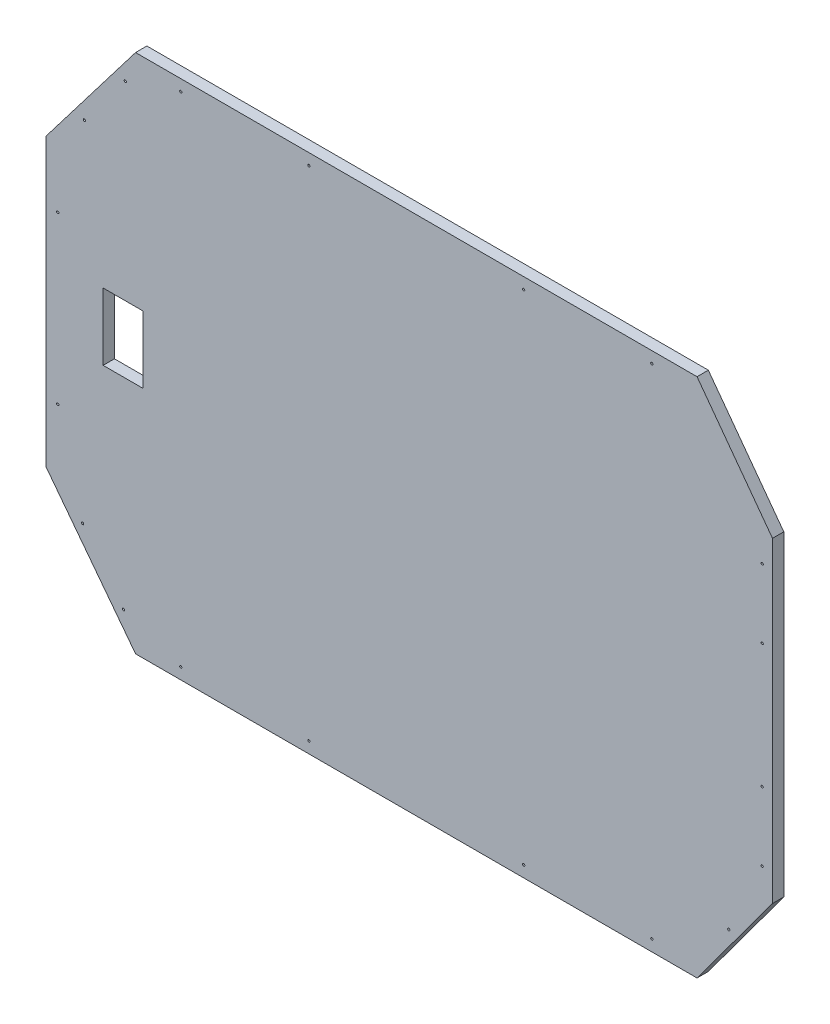
ISO-10303-21;
HEADER;
FILE_DESCRIPTION(('STEP AP214'),'2;1');
FILE_NAME('part.step','',(''),(''),'','','');
FILE_SCHEMA(('AUTOMOTIVE_DESIGN { 1 0 10303 214 1 1 1 1 }'));
ENDSEC;
DATA;
#1=APPLICATION_CONTEXT('core data for automotive mechanical design processes');
#2=APPLICATION_PROTOCOL_DEFINITION('international standard','automotive_design',2000,#1);
#3=PRODUCT_CONTEXT('',#1,'mechanical');
#4=PRODUCT('Part','Part','',(#3));
#5=PRODUCT_RELATED_PRODUCT_CATEGORY('part','',(#4));
#6=PRODUCT_DEFINITION_FORMATION('','',#4);
#7=PRODUCT_DEFINITION_CONTEXT('part definition',#1,'design');
#8=PRODUCT_DEFINITION('design','',#6,#7);
#9=PRODUCT_DEFINITION_SHAPE('','',#8);
#10=(LENGTH_UNIT() NAMED_UNIT(*) SI_UNIT(.MILLI.,.METRE.));
#11=(NAMED_UNIT(*) PLANE_ANGLE_UNIT() SI_UNIT($,.RADIAN.));
#12=(NAMED_UNIT(*) SI_UNIT($,.STERADIAN.) SOLID_ANGLE_UNIT());
#13=UNCERTAINTY_MEASURE_WITH_UNIT(LENGTH_MEASURE(1.E-05),#10,'distance_accuracy_value','');
#14=(GEOMETRIC_REPRESENTATION_CONTEXT(3) GLOBAL_UNCERTAINTY_ASSIGNED_CONTEXT((#13)) GLOBAL_UNIT_ASSIGNED_CONTEXT((#10,
#11,#12)) REPRESENTATION_CONTEXT('',''));
#15=CARTESIAN_POINT('',(0.,0.,0.));
#16=DIRECTION('',(0.,0.,1.));
#17=DIRECTION('',(1.,0.,0.));
#18=AXIS2_PLACEMENT_3D('',#15,#16,#17);
#19=CARTESIAN_POINT('',(0.,881.270435869662,15.));
#20=DIRECTION('',(1.,0.,0.));
#21=DIRECTION('',(0.,0.,-1.));
#22=AXIS2_PLACEMENT_3D('',#19,#20,#21);
#23=PLANE('',#22);
#24=DIRECTION('',(0.,-1.,0.));
#25=VECTOR('',#24,1.);
#26=CARTESIAN_POINT('',(0.,881.270435869662,0.));
#27=LINE('',#26,#25);
#28=CARTESIAN_POINT('',(0.,881.270435869662,0.));
#29=VERTEX_POINT('',#28);
#30=CARTESIAN_POINT('',(0.,500.680435869662,0.));
#31=VERTEX_POINT('',#30);
#32=EDGE_CURVE('E236',#29,#31,#27,.T.);
#33=ORIENTED_EDGE('',*,*,#32,.T.);
#34=DIRECTION('',(0.,0.,-1.));
#35=VECTOR('',#34,1.);
#36=CARTESIAN_POINT('',(0.,500.680435869662,15.));
#37=LINE('',#36,#35);
#38=CARTESIAN_POINT('',(0.,500.680435869662,15.));
#39=VERTEX_POINT('',#38);
#40=EDGE_CURVE('E11',#39,#31,#37,.T.);
#41=ORIENTED_EDGE('',*,*,#40,.F.);
#42=DIRECTION('',(0.,-1.,0.));
#43=VECTOR('',#42,1.);
#44=CARTESIAN_POINT('',(0.,881.270435869662,15.));
#45=LINE('',#44,#43);
#46=CARTESIAN_POINT('',(0.,881.270435869662,15.));
#47=VERTEX_POINT('',#46);
#48=EDGE_CURVE('E217',#47,#39,#45,.T.);
#49=ORIENTED_EDGE('',*,*,#48,.F.);
#50=DIRECTION('',(0.,0.,-1.));
#51=VECTOR('',#50,1.);
#52=CARTESIAN_POINT('',(0.,881.270435869662,15.));
#53=LINE('',#52,#51);
#54=EDGE_CURVE('E235',#47,#29,#53,.T.);
#55=ORIENTED_EDGE('',*,*,#54,.T.);
#56=EDGE_LOOP('',(#33,#41,#49,#55));
#57=FACE_BOUND('',#56,.T.);
#58=ADVANCED_FACE('F33',(#57),#23,.F.);
#59=CARTESIAN_POINT('',(0.,500.680435869662,15.));
#60=DIRECTION('',(0.794596886666484,0.607137371358353,0.));
#61=DIRECTION('',(-0.607137371358353,0.794596886666484,0.));
#62=AXIS2_PLACEMENT_3D('',#59,#60,#61);
#63=PLANE('',#62);
#64=DIRECTION('',(0.607137371358353,-0.794596886666484,0.));
#65=VECTOR('',#64,1.);
#66=CARTESIAN_POINT('',(0.,500.680435869662,0.));
#67=LINE('',#66,#65);
#68=CARTESIAN_POINT('',(118.58,345.487717934831,0.));
#69=VERTEX_POINT('',#68);
#70=EDGE_CURVE('E239',#31,#69,#67,.T.);
#71=ORIENTED_EDGE('',*,*,#70,.T.);
#72=DIRECTION('',(0.,0.,-1.));
#73=VECTOR('',#72,1.);
#74=CARTESIAN_POINT('',(118.58,345.487717934831,15.));
#75=LINE('',#74,#73);
#76=CARTESIAN_POINT('',(118.58,345.487717934831,15.));
#77=VERTEX_POINT('',#76);
#78=EDGE_CURVE('E41',#77,#69,#75,.T.);
#79=ORIENTED_EDGE('',*,*,#78,.F.);
#80=DIRECTION('',(0.607137371358353,-0.794596886666484,0.));
#81=VECTOR('',#80,1.);
#82=CARTESIAN_POINT('',(0.,500.680435869662,15.));
#83=LINE('',#82,#81);
#84=EDGE_CURVE('E220',#39,#77,#83,.T.);
#85=ORIENTED_EDGE('',*,*,#84,.F.);
#86=ORIENTED_EDGE('',*,*,#40,.T.);
#87=EDGE_LOOP('',(#71,#79,#85,#86));
#88=FACE_BOUND('',#87,.T.);
#89=ADVANCED_FACE('F346',(#88),#63,.F.);
#90=CARTESIAN_POINT('',(118.58,345.487717934831,15.));
#91=DIRECTION('',(0.,1.,0.));
#92=DIRECTION('',(0.,0.,1.));
#93=AXIS2_PLACEMENT_3D('',#90,#91,#92);
#94=PLANE('',#93);
#95=DIRECTION('',(1.,0.,0.));
#96=VECTOR('',#95,1.);
#97=CARTESIAN_POINT('',(118.58,345.487717934831,0.));
#98=LINE('',#97,#96);
#99=CARTESIAN_POINT('',(863.58,345.487717934831,0.));
#100=VERTEX_POINT('',#99);
#101=EDGE_CURVE('E241',#69,#100,#98,.T.);
#102=ORIENTED_EDGE('',*,*,#101,.T.);
#103=DIRECTION('',(0.,0.,-1.));
#104=VECTOR('',#103,1.);
#105=CARTESIAN_POINT('',(863.58,345.487717934831,15.));
#106=LINE('',#105,#104);
#107=CARTESIAN_POINT('',(863.58,345.487717934831,15.));
#108=VERTEX_POINT('',#107);
#109=EDGE_CURVE('E266',#108,#100,#106,.T.);
#110=ORIENTED_EDGE('',*,*,#109,.F.);
#111=DIRECTION('',(1.,0.,0.));
#112=VECTOR('',#111,1.);
#113=CARTESIAN_POINT('',(118.58,345.487717934831,15.));
#114=LINE('',#113,#112);
#115=EDGE_CURVE('E223',#77,#108,#114,.T.);
#116=ORIENTED_EDGE('',*,*,#115,.F.);
#117=ORIENTED_EDGE('',*,*,#78,.T.);
#118=EDGE_LOOP('',(#102,#110,#116,#117));
#119=FACE_BOUND('',#118,.T.);
#120=ADVANCED_FACE('F351',(#119),#94,.F.);
#121=CARTESIAN_POINT('',(863.58,345.487717934831,15.));
#122=DIRECTION('',(-0.804571609640296,0.593855643200285,0.));
#123=DIRECTION('',(-0.593855643200285,-0.804571609640296,0.));
#124=AXIS2_PLACEMENT_3D('',#121,#122,#123);
#125=PLANE('',#124);
#126=DIRECTION('',(0.593855643200285,0.804571609640296,0.));
#127=VECTOR('',#126,1.);
#128=CARTESIAN_POINT('',(863.58,345.487717934831,0.));
#129=LINE('',#128,#127);
#130=CARTESIAN_POINT('',(963.71,481.146537036281,0.));
#131=VERTEX_POINT('',#130);
#132=EDGE_CURVE('E243',#100,#131,#129,.T.);
#133=ORIENTED_EDGE('',*,*,#132,.T.);
#134=DIRECTION('',(0.,0.,-1.));
#135=VECTOR('',#134,1.);
#136=CARTESIAN_POINT('',(963.71,481.146537036281,15.));
#137=LINE('',#136,#135);
#138=CARTESIAN_POINT('',(963.71,481.146537036281,15.));
#139=VERTEX_POINT('',#138);
#140=EDGE_CURVE('E263',#139,#131,#137,.T.);
#141=ORIENTED_EDGE('',*,*,#140,.F.);
#142=DIRECTION('',(0.593855643200285,0.804571609640296,0.));
#143=VECTOR('',#142,1.);
#144=CARTESIAN_POINT('',(863.58,345.487717934831,15.));
#145=LINE('',#144,#143);
#146=EDGE_CURVE('E225',#108,#139,#145,.T.);
#147=ORIENTED_EDGE('',*,*,#146,.F.);
#148=ORIENTED_EDGE('',*,*,#109,.T.);
#149=EDGE_LOOP('',(#133,#141,#147,#148));
#150=FACE_BOUND('',#149,.T.);
#151=ADVANCED_FACE('F385',(#150),#125,.F.);
#152=CARTESIAN_POINT('',(963.71,481.146537036281,15.));
#153=DIRECTION('',(-1.,0.,0.));
#154=DIRECTION('',(0.,0.,1.));
#155=AXIS2_PLACEMENT_3D('',#152,#153,#154);
#156=PLANE('',#155);
#157=DIRECTION('',(0.,1.,0.));
#158=VECTOR('',#157,1.);
#159=CARTESIAN_POINT('',(963.71,481.146537036281,0.));
#160=LINE('',#159,#158);
#161=CARTESIAN_POINT('',(963.71,900.804334703043,0.));
#162=VERTEX_POINT('',#161);
#163=EDGE_CURVE('E245',#131,#162,#160,.T.);
#164=ORIENTED_EDGE('',*,*,#163,.T.);
#165=DIRECTION('',(0.,0.,-1.));
#166=VECTOR('',#165,1.);
#167=CARTESIAN_POINT('',(963.71,900.804334703043,15.));
#168=LINE('',#167,#166);
#169=CARTESIAN_POINT('',(963.71,900.804334703043,15.));
#170=VERTEX_POINT('',#169);
#171=EDGE_CURVE('E260',#170,#162,#168,.T.);
#172=ORIENTED_EDGE('',*,*,#171,.F.);
#173=DIRECTION('',(0.,1.,0.));
#174=VECTOR('',#173,1.);
#175=CARTESIAN_POINT('',(963.71,481.146537036281,15.));
#176=LINE('',#175,#174);
#177=EDGE_CURVE('E227',#139,#170,#176,.T.);
#178=ORIENTED_EDGE('',*,*,#177,.F.);
#179=ORIENTED_EDGE('',*,*,#140,.T.);
#180=EDGE_LOOP('',(#164,#172,#178,#179));
#181=FACE_BOUND('',#180,.T.);
#182=ADVANCED_FACE('F381',(#181),#156,.F.);
#183=CARTESIAN_POINT('',(963.71,900.804334703043,15.));
#184=DIRECTION('',(-0.804571609640296,-0.593855643200284,0.));
#185=DIRECTION('',(0.593855643200284,-0.804571609640296,0.));
#186=AXIS2_PLACEMENT_3D('',#183,#184,#185);
#187=PLANE('',#186);
#188=DIRECTION('',(-0.593855643200284,0.804571609640296,0.));
#189=VECTOR('',#188,1.);
#190=CARTESIAN_POINT('',(963.71,900.804334703043,0.));
#191=LINE('',#190,#189);
#192=CARTESIAN_POINT('',(863.58,1036.46315380449,0.));
#193=VERTEX_POINT('',#192);
#194=EDGE_CURVE('E247',#162,#193,#191,.T.);
#195=ORIENTED_EDGE('',*,*,#194,.T.);
#196=DIRECTION('',(0.,0.,-1.));
#197=VECTOR('',#196,1.);
#198=CARTESIAN_POINT('',(863.58,1036.46315380449,15.));
#199=LINE('',#198,#197);
#200=CARTESIAN_POINT('',(863.58,1036.46315380449,15.));
#201=VERTEX_POINT('',#200);
#202=EDGE_CURVE('E257',#201,#193,#199,.T.);
#203=ORIENTED_EDGE('',*,*,#202,.F.);
#204=DIRECTION('',(-0.593855643200284,0.804571609640296,0.));
#205=VECTOR('',#204,1.);
#206=CARTESIAN_POINT('',(963.71,900.804334703043,15.));
#207=LINE('',#206,#205);
#208=EDGE_CURVE('E229',#170,#201,#207,.T.);
#209=ORIENTED_EDGE('',*,*,#208,.F.);
#210=ORIENTED_EDGE('',*,*,#171,.T.);
#211=EDGE_LOOP('',(#195,#203,#209,#210));
#212=FACE_BOUND('',#211,.T.);
#213=ADVANCED_FACE('F376',(#212),#187,.F.);
#214=CARTESIAN_POINT('',(863.58,1036.46315380449,15.));
#215=DIRECTION('',(0.,-1.,0.));
#216=DIRECTION('',(0.,0.,-1.));
#217=AXIS2_PLACEMENT_3D('',#214,#215,#216);
#218=PLANE('',#217);
#219=DIRECTION('',(-1.,0.,0.));
#220=VECTOR('',#219,1.);
#221=CARTESIAN_POINT('',(863.58,1036.46315380449,0.));
#222=LINE('',#221,#220);
#223=CARTESIAN_POINT('',(118.58,1036.46315380449,0.));
#224=VERTEX_POINT('',#223);
#225=EDGE_CURVE('E249',#193,#224,#222,.T.);
#226=ORIENTED_EDGE('',*,*,#225,.T.);
#227=DIRECTION('',(0.,0.,-1.));
#228=VECTOR('',#227,1.);
#229=CARTESIAN_POINT('',(118.58,1036.46315380449,15.));
#230=LINE('',#229,#228);
#231=CARTESIAN_POINT('',(118.58,1036.46315380449,15.));
#232=VERTEX_POINT('',#231);
#233=EDGE_CURVE('E254',#232,#224,#230,.T.);
#234=ORIENTED_EDGE('',*,*,#233,.F.);
#235=DIRECTION('',(-1.,0.,0.));
#236=VECTOR('',#235,1.);
#237=CARTESIAN_POINT('',(863.58,1036.46315380449,15.));
#238=LINE('',#237,#236);
#239=EDGE_CURVE('E231',#201,#232,#238,.T.);
#240=ORIENTED_EDGE('',*,*,#239,.F.);
#241=ORIENTED_EDGE('',*,*,#202,.T.);
#242=EDGE_LOOP('',(#226,#234,#240,#241));
#243=FACE_BOUND('',#242,.T.);
#244=ADVANCED_FACE('F371',(#243),#218,.F.);
#245=CARTESIAN_POINT('',(118.58,1036.46315380449,15.));
#246=DIRECTION('',(0.794596886666484,-0.607137371358353,0.));
#247=DIRECTION('',(0.607137371358353,0.794596886666484,0.));
#248=AXIS2_PLACEMENT_3D('',#245,#246,#247);
#249=PLANE('',#248);
#250=DIRECTION('',(-0.607137371358353,-0.794596886666484,0.));
#251=VECTOR('',#250,1.);
#252=CARTESIAN_POINT('',(118.58,1036.46315380449,0.));
#253=LINE('',#252,#251);
#254=EDGE_CURVE('E221',#224,#29,#253,.T.);
#255=ORIENTED_EDGE('',*,*,#254,.T.);
#256=ORIENTED_EDGE('',*,*,#54,.F.);
#257=DIRECTION('',(-0.607137371358353,-0.794596886666484,0.));
#258=VECTOR('',#257,1.);
#259=CARTESIAN_POINT('',(118.58,1036.46315380449,15.));
#260=LINE('',#259,#258);
#261=EDGE_CURVE('E233',#232,#47,#260,.T.);
#262=ORIENTED_EDGE('',*,*,#261,.F.);
#263=ORIENTED_EDGE('',*,*,#233,.T.);
#264=EDGE_LOOP('',(#255,#256,#262,#263));
#265=FACE_BOUND('',#264,.T.);
#266=ADVANCED_FACE('F369',(#265),#249,.F.);
#267=CARTESIAN_POINT('',(0.,0.,15.));
#268=DIRECTION('',(0.,0.,1.));
#269=DIRECTION('',(1.,0.,0.));
#270=AXIS2_PLACEMENT_3D('',#267,#268,#269);
#271=PLANE('',#270);
#272=DIRECTION('',(0.,-1.,0.));
#273=VECTOR('',#272,1.);
#274=CARTESIAN_POINT('',(128.150001448379,744.3942259735,15.));
#275=LINE('',#274,#273);
#276=CARTESIAN_POINT('',(128.150001448379,744.3942259735,15.));
#277=VERTEX_POINT('',#276);
#278=CARTESIAN_POINT('',(128.150001448379,655.4942259735,15.));
#279=VERTEX_POINT('',#278);
#280=EDGE_CURVE('E125',#277,#279,#275,.T.);
#281=ORIENTED_EDGE('',*,*,#280,.T.);
#282=DIRECTION('',(-1.,0.,0.));
#283=VECTOR('',#282,1.);
#284=CARTESIAN_POINT('',(128.150001448379,655.4942259735,15.));
#285=LINE('',#284,#283);
#286=CARTESIAN_POINT('',(75.550001448379,655.4942259735,15.));
#287=VERTEX_POINT('',#286);
#288=EDGE_CURVE('E134',#279,#287,#285,.T.);
#289=ORIENTED_EDGE('',*,*,#288,.T.);
#290=DIRECTION('',(0.,1.,0.));
#291=VECTOR('',#290,1.);
#292=CARTESIAN_POINT('',(75.550001448379,744.3942259735,15.));
#293=LINE('',#292,#291);
#294=CARTESIAN_POINT('',(75.550001448379,744.3942259735,15.));
#295=VERTEX_POINT('',#294);
#296=EDGE_CURVE('E49',#287,#295,#293,.T.);
#297=ORIENTED_EDGE('',*,*,#296,.T.);
#298=DIRECTION('',(1.,0.,0.));
#299=VECTOR('',#298,1.);
#300=CARTESIAN_POINT('',(128.150001448379,744.3942259735,15.));
#301=LINE('',#300,#299);
#302=EDGE_CURVE('E131',#295,#277,#301,.T.);
#303=ORIENTED_EDGE('',*,*,#302,.T.);
#304=EDGE_LOOP('',(#281,#289,#297,#303));
#305=FACE_BOUND('',#304,.T.);
#306=CARTESIAN_POINT('',(48.2963759549845,460.306715340102,15.));
#307=DIRECTION('',(0.,0.,-1.));
#308=DIRECTION('',(-1.,0.,0.));
#309=AXIS2_PLACEMENT_3D('',#306,#307,#308);
#310=CIRCLE('',#309,1.49999999999999);
#311=CARTESIAN_POINT('',(46.7963759549845,460.306715340102,15.));
#312=VERTEX_POINT('',#311);
#313=EDGE_CURVE('E175',#312,#312,#310,.T.);
#314=ORIENTED_EDGE('',*,*,#313,.T.);
#315=EDGE_LOOP('',(#314));
#316=FACE_BOUND('',#315,.T.);
#317=CARTESIAN_POINT('',(803.58,360.487717934831,15.));
#318=DIRECTION('',(0.,0.,-1.));
#319=DIRECTION('',(-1.,0.,0.));
#320=AXIS2_PLACEMENT_3D('',#317,#318,#319);
#321=CIRCLE('',#320,1.50000000000008);
#322=CARTESIAN_POINT('',(802.08,360.487717934831,15.));
#323=VERTEX_POINT('',#322);
#324=EDGE_CURVE('E178',#323,#323,#321,.T.);
#325=ORIENTED_EDGE('',*,*,#324,.T.);
#326=EDGE_LOOP('',(#325));
#327=FACE_BOUND('',#326,.T.);
#328=CARTESIAN_POINT('',(633.58,360.487717934831,15.));
#329=DIRECTION('',(0.,0.,-1.));
#330=DIRECTION('',(-1.,0.,0.));
#331=AXIS2_PLACEMENT_3D('',#328,#329,#330);
#332=CIRCLE('',#331,1.50000000000008);
#333=CARTESIAN_POINT('',(632.08,360.487717934831,15.));
#334=VERTEX_POINT('',#333);
#335=EDGE_CURVE('E181',#334,#334,#332,.T.);
#336=ORIENTED_EDGE('',*,*,#335,.T.);
#337=EDGE_LOOP('',(#336));
#338=FACE_BOUND('',#337,.T.);
#339=CARTESIAN_POINT('',(15.3286989662178,580.680435869662,15.));
#340=DIRECTION('',(0.,0.,-1.));
#341=DIRECTION('',(-1.,0.,0.));
#342=AXIS2_PLACEMENT_3D('',#339,#340,#341);
#343=CIRCLE('',#342,1.50000000000006);
#344=CARTESIAN_POINT('',(13.8286989662178,580.680435869662,15.));
#345=VERTEX_POINT('',#344);
#346=EDGE_CURVE('E184',#345,#345,#343,.T.);
#347=ORIENTED_EDGE('',*,*,#346,.T.);
#348=EDGE_LOOP('',(#347));
#349=FACE_BOUND('',#348,.T.);
#350=CARTESIAN_POINT('',(950.019491684241,864.740901449589,15.));
#351=DIRECTION('',(0.,0.,-1.));
#352=DIRECTION('',(-1.,0.,0.));
#353=AXIS2_PLACEMENT_3D('',#350,#351,#352);
#354=CIRCLE('',#353,1.49999999999997);
#355=CARTESIAN_POINT('',(948.519491684241,864.740901449589,15.));
#356=VERTEX_POINT('',#355);
#357=EDGE_CURVE('E163',#356,#356,#354,.T.);
#358=ORIENTED_EDGE('',*,*,#357,.T.);
#359=EDGE_LOOP('',(#358));
#360=FACE_BOUND('',#359,.T.);
#361=CARTESIAN_POINT('',(102.481993542715,388.44630310474,15.));
#362=DIRECTION('',(0.,0.,-1.));
#363=DIRECTION('',(-1.,0.,0.));
#364=AXIS2_PLACEMENT_3D('',#361,#362,#363);
#365=CIRCLE('',#364,1.49999999999999);
#366=CARTESIAN_POINT('',(100.981993542715,388.44630310474,15.));
#367=VERTEX_POINT('',#366);
#368=EDGE_CURVE('E166',#367,#367,#365,.T.);
#369=ORIENTED_EDGE('',*,*,#368,.T.);
#370=EDGE_LOOP('',(#369));
#371=FACE_BOUND('',#370,.T.);
#372=CARTESIAN_POINT('',(950.019491684241,517.220901449589,15.));
#373=DIRECTION('',(0.,0.,-1.));
#374=DIRECTION('',(-1.,0.,0.));
#375=AXIS2_PLACEMENT_3D('',#372,#373,#374);
#376=CIRCLE('',#375,1.49999999999997);
#377=CARTESIAN_POINT('',(948.519491684241,517.220901449589,15.));
#378=VERTEX_POINT('',#377);
#379=EDGE_CURVE('E169',#378,#378,#376,.T.);
#380=ORIENTED_EDGE('',*,*,#379,.T.);
#381=EDGE_LOOP('',(#380));
#382=FACE_BOUND('',#381,.T.);
#383=CARTESIAN_POINT('',(905.654330920867,422.2697364722,15.));
#384=DIRECTION('',(0.,0.,-1.));
#385=DIRECTION('',(-1.,0.,0.));
#386=AXIS2_PLACEMENT_3D('',#383,#384,#385);
#387=CIRCLE('',#386,1.49999999999997);
#388=CARTESIAN_POINT('',(904.154330920867,422.2697364722,15.));
#389=VERTEX_POINT('',#388);
#390=EDGE_CURVE('E172',#389,#389,#387,.T.);
#391=ORIENTED_EDGE('',*,*,#390,.T.);
#392=EDGE_LOOP('',(#391));
#393=FACE_BOUND('',#392,.T.);
#394=CARTESIAN_POINT('',(803.58,1021.46315380449,15.));
#395=DIRECTION('',(0.,0.,-1.));
#396=DIRECTION('',(-1.,0.,0.));
#397=AXIS2_PLACEMENT_3D('',#394,#395,#396);
#398=CIRCLE('',#397,1.49999999999994);
#399=CARTESIAN_POINT('',(802.08,1021.46315380449,15.));
#400=VERTEX_POINT('',#399);
#401=EDGE_CURVE('E202',#400,#400,#398,.T.);
#402=ORIENTED_EDGE('',*,*,#401,.T.);
#403=EDGE_LOOP('',(#402));
#404=FACE_BOUND('',#403,.T.);
#405=CARTESIAN_POINT('',(633.58,1021.46315380449,15.));
#406=DIRECTION('',(0.,0.,-1.));
#407=DIRECTION('',(-1.,0.,0.));
#408=AXIS2_PLACEMENT_3D('',#405,#406,#407);
#409=CIRCLE('',#408,1.49999999999994);
#410=CARTESIAN_POINT('',(632.08,1021.46315380449,15.));
#411=VERTEX_POINT('',#410);
#412=EDGE_CURVE('E206',#411,#411,#409,.T.);
#413=ORIENTED_EDGE('',*,*,#412,.T.);
#414=EDGE_LOOP('',(#413));
#415=FACE_BOUND('',#414,.T.);
#416=CARTESIAN_POINT('',(104.885574294001,996.692172860903,15.));
#417=DIRECTION('',(0.,0.,-1.));
#418=DIRECTION('',(-1.,0.,0.));
#419=AXIS2_PLACEMENT_3D('',#416,#417,#418);
#420=CIRCLE('',#419,1.49999999999995);
#421=CARTESIAN_POINT('',(103.385574294001,996.692172860903,15.));
#422=VERTEX_POINT('',#421);
#423=EDGE_CURVE('E209',#422,#422,#420,.T.);
#424=ORIENTED_EDGE('',*,*,#423,.T.);
#425=EDGE_LOOP('',(#424));
#426=FACE_BOUND('',#425,.T.);
#427=CARTESIAN_POINT('',(348.58,1021.46315380449,15.));
#428=DIRECTION('',(0.,0.,-1.));
#429=DIRECTION('',(-1.,0.,0.));
#430=AXIS2_PLACEMENT_3D('',#427,#428,#429);
#431=CIRCLE('',#430,1.49999999999994);
#432=CARTESIAN_POINT('',(347.08,1021.46315380449,15.));
#433=VERTEX_POINT('',#432);
#434=EDGE_CURVE('E193',#433,#433,#431,.T.);
#435=ORIENTED_EDGE('',*,*,#434,.T.);
#436=EDGE_LOOP('',(#435));
#437=FACE_BOUND('',#436,.T.);
#438=CARTESIAN_POINT('',(178.58,1021.46315380449,15.));
#439=DIRECTION('',(0.,0.,-1.));
#440=DIRECTION('',(-1.,0.,0.));
#441=AXIS2_PLACEMENT_3D('',#438,#439,#440);
#442=CIRCLE('',#441,1.49999999999994);
#443=CARTESIAN_POINT('',(177.08,1021.46315380449,15.));
#444=VERTEX_POINT('',#443);
#445=EDGE_CURVE('E190',#444,#444,#442,.T.);
#446=ORIENTED_EDGE('',*,*,#445,.T.);
#447=EDGE_LOOP('',(#446));
#448=FACE_BOUND('',#447,.T.);
#449=CARTESIAN_POINT('',(15.3286989662178,801.270435869662,15.));
#450=DIRECTION('',(0.,0.,-1.));
#451=DIRECTION('',(-1.,0.,0.));
#452=AXIS2_PLACEMENT_3D('',#449,#450,#451);
#453=CIRCLE('',#452,1.50000000000006);
#454=CARTESIAN_POINT('',(13.8286989662178,801.270435869662,15.));
#455=VERTEX_POINT('',#454);
#456=EDGE_CURVE('E194',#455,#455,#453,.T.);
#457=ORIENTED_EDGE('',*,*,#456,.T.);
#458=EDGE_LOOP('',(#457));
#459=FACE_BOUND('',#458,.T.);
#460=CARTESIAN_POINT('',(178.58,360.487717934831,15.));
#461=DIRECTION('',(0.,0.,-1.));
#462=DIRECTION('',(-1.,0.,0.));
#463=AXIS2_PLACEMENT_3D('',#460,#461,#462);
#464=CIRCLE('',#463,1.5);
#465=CARTESIAN_POINT('',(177.08,360.487717934831,15.));
#466=VERTEX_POINT('',#465);
#467=EDGE_CURVE('E197',#466,#466,#464,.T.);
#468=ORIENTED_EDGE('',*,*,#467,.T.);
#469=EDGE_LOOP('',(#468));
#470=FACE_BOUND('',#469,.T.);
#471=CARTESIAN_POINT('',(348.58,360.487717934831,15.));
#472=DIRECTION('',(0.,0.,-1.));
#473=DIRECTION('',(-1.,0.,0.));
#474=AXIS2_PLACEMENT_3D('',#471,#472,#473);
#475=CIRCLE('',#474,1.50000000000002);
#476=CARTESIAN_POINT('',(347.08,360.487717934831,15.));
#477=VERTEX_POINT('',#476);
#478=EDGE_CURVE('E187',#477,#477,#475,.T.);
#479=ORIENTED_EDGE('',*,*,#478,.T.);
#480=EDGE_LOOP('',(#479));
#481=FACE_BOUND('',#480,.T.);
#482=CARTESIAN_POINT('',(950.019491684241,773.326890580185,15.));
#483=DIRECTION('',(0.,0.,-1.));
#484=DIRECTION('',(-1.,0.,0.));
#485=AXIS2_PLACEMENT_3D('',#482,#483,#484);
#486=CIRCLE('',#485,1.49999999999997);
#487=CARTESIAN_POINT('',(948.519491684241,773.326890580185,15.));
#488=VERTEX_POINT('',#487);
#489=EDGE_CURVE('E160',#488,#488,#486,.T.);
#490=ORIENTED_EDGE('',*,*,#489,.T.);
#491=EDGE_LOOP('',(#490));
#492=FACE_BOUND('',#491,.T.);
#493=CARTESIAN_POINT('',(950.019491684241,608.634912318993,15.));
#494=DIRECTION('',(0.,0.,-1.));
#495=DIRECTION('',(-1.,0.,0.));
#496=AXIS2_PLACEMENT_3D('',#493,#494,#495);
#497=CIRCLE('',#496,1.49999999999997);
#498=CARTESIAN_POINT('',(948.519491684241,608.634912318993,15.));
#499=VERTEX_POINT('',#498);
#500=EDGE_CURVE('E156',#499,#499,#497,.T.);
#501=ORIENTED_EDGE('',*,*,#500,.T.);
#502=EDGE_LOOP('',(#501));
#503=FACE_BOUND('',#502,.T.);
#504=CARTESIAN_POINT('',(50.6999567062694,924.831760625541,15.));
#505=DIRECTION('',(0.,0.,-1.));
#506=DIRECTION('',(-1.,0.,0.));
#507=AXIS2_PLACEMENT_3D('',#504,#505,#506);
#508=CIRCLE('',#507,1.5);
#509=CARTESIAN_POINT('',(49.1999567062694,924.831760625541,15.));
#510=VERTEX_POINT('',#509);
#511=EDGE_CURVE('E205',#510,#510,#508,.T.);
#512=ORIENTED_EDGE('',*,*,#511,.T.);
#513=EDGE_LOOP('',(#512));
#514=FACE_BOUND('',#513,.T.);
#515=ORIENTED_EDGE('',*,*,#48,.T.);
#516=ORIENTED_EDGE('',*,*,#84,.T.);
#517=ORIENTED_EDGE('',*,*,#115,.T.);
#518=ORIENTED_EDGE('',*,*,#146,.T.);
#519=ORIENTED_EDGE('',*,*,#177,.T.);
#520=ORIENTED_EDGE('',*,*,#208,.T.);
#521=ORIENTED_EDGE('',*,*,#239,.T.);
#522=ORIENTED_EDGE('',*,*,#261,.T.);
#523=EDGE_LOOP('',(#515,#516,#517,#518,#519,#520,#521,#522));
#524=FACE_BOUND('',#523,.T.);
#525=ADVANCED_FACE('F138',(#305,#316,#327,#338,#349,#360,#371,#382,#393,#404,#415,#426,#437,
#448,#459,#470,#481,#492,#503,#514,#524),#271,.T.);
#526=CARTESIAN_POINT('',(0.,0.,0.));
#527=DIRECTION('',(0.,0.,1.));
#528=DIRECTION('',(1.,0.,0.));
#529=AXIS2_PLACEMENT_3D('',#526,#527,#528);
#530=PLANE('',#529);
#531=DIRECTION('',(-1.,0.,0.));
#532=VECTOR('',#531,1.);
#533=CARTESIAN_POINT('',(128.150001448379,655.4942259735,0.));
#534=LINE('',#533,#532);
#535=CARTESIAN_POINT('',(128.150001448379,655.4942259735,0.));
#536=VERTEX_POINT('',#535);
#537=CARTESIAN_POINT('',(75.550001448379,655.4942259735,0.));
#538=VERTEX_POINT('',#537);
#539=EDGE_CURVE('E150',#536,#538,#534,.T.);
#540=ORIENTED_EDGE('',*,*,#539,.F.);
#541=DIRECTION('',(0.,-1.,0.));
#542=VECTOR('',#541,1.);
#543=CARTESIAN_POINT('',(128.150001448379,744.3942259735,0.));
#544=LINE('',#543,#542);
#545=CARTESIAN_POINT('',(128.150001448379,744.3942259735,0.));
#546=VERTEX_POINT('',#545);
#547=EDGE_CURVE('E57',#546,#536,#544,.T.);
#548=ORIENTED_EDGE('',*,*,#547,.F.);
#549=DIRECTION('',(1.,0.,0.));
#550=VECTOR('',#549,1.);
#551=CARTESIAN_POINT('',(128.150001448379,744.3942259735,0.));
#552=LINE('',#551,#550);
#553=CARTESIAN_POINT('',(75.550001448379,744.3942259735,0.));
#554=VERTEX_POINT('',#553);
#555=EDGE_CURVE('E141',#554,#546,#552,.T.);
#556=ORIENTED_EDGE('',*,*,#555,.F.);
#557=DIRECTION('',(0.,1.,0.));
#558=VECTOR('',#557,1.);
#559=CARTESIAN_POINT('',(75.550001448379,744.3942259735,0.));
#560=LINE('',#559,#558);
#561=EDGE_CURVE('E144',#538,#554,#560,.T.);
#562=ORIENTED_EDGE('',*,*,#561,.F.);
#563=EDGE_LOOP('',(#540,#548,#556,#562));
#564=FACE_BOUND('',#563,.T.);
#565=CARTESIAN_POINT('',(48.2963759549845,460.306715340102,0.));
#566=DIRECTION('',(0.,0.,1.));
#567=DIRECTION('',(1.,0.,0.));
#568=AXIS2_PLACEMENT_3D('',#565,#566,#567);
#569=CIRCLE('',#568,1.49999999999999);
#570=CARTESIAN_POINT('',(49.7963759549845,460.306715340102,0.));
#571=VERTEX_POINT('',#570);
#572=EDGE_CURVE('E36',#571,#571,#569,.T.);
#573=ORIENTED_EDGE('',*,*,#572,.T.);
#574=EDGE_LOOP('',(#573));
#575=FACE_BOUND('',#574,.T.);
#576=CARTESIAN_POINT('',(803.58,360.487717934831,0.));
#577=DIRECTION('',(0.,0.,1.));
#578=DIRECTION('',(1.,0.,0.));
#579=AXIS2_PLACEMENT_3D('',#576,#577,#578);
#580=CIRCLE('',#579,1.50000000000008);
#581=CARTESIAN_POINT('',(805.08,360.487717934831,0.));
#582=VERTEX_POINT('',#581);
#583=EDGE_CURVE('E320',#582,#582,#580,.T.);
#584=ORIENTED_EDGE('',*,*,#583,.T.);
#585=EDGE_LOOP('',(#584));
#586=FACE_BOUND('',#585,.T.);
#587=CARTESIAN_POINT('',(633.58,360.487717934831,0.));
#588=DIRECTION('',(0.,0.,1.));
#589=DIRECTION('',(1.,0.,0.));
#590=AXIS2_PLACEMENT_3D('',#587,#588,#589);
#591=CIRCLE('',#590,1.50000000000008);
#592=CARTESIAN_POINT('',(635.08,360.487717934831,0.));
#593=VERTEX_POINT('',#592);
#594=EDGE_CURVE('E318',#593,#593,#591,.T.);
#595=ORIENTED_EDGE('',*,*,#594,.T.);
#596=EDGE_LOOP('',(#595));
#597=FACE_BOUND('',#596,.T.);
#598=CARTESIAN_POINT('',(15.3286989662178,580.680435869662,0.));
#599=DIRECTION('',(0.,0.,1.));
#600=DIRECTION('',(1.,0.,0.));
#601=AXIS2_PLACEMENT_3D('',#598,#599,#600);
#602=CIRCLE('',#601,1.50000000000006);
#603=CARTESIAN_POINT('',(16.8286989662179,580.680435869662,0.));
#604=VERTEX_POINT('',#603);
#605=EDGE_CURVE('E315',#604,#604,#602,.T.);
#606=ORIENTED_EDGE('',*,*,#605,.T.);
#607=EDGE_LOOP('',(#606));
#608=FACE_BOUND('',#607,.T.);
#609=CARTESIAN_POINT('',(950.019491684241,864.740901449589,0.));
#610=DIRECTION('',(0.,0.,1.));
#611=DIRECTION('',(1.,0.,0.));
#612=AXIS2_PLACEMENT_3D('',#609,#610,#611);
#613=CIRCLE('',#612,1.49999999999997);
#614=CARTESIAN_POINT('',(951.519491684241,864.740901449589,0.));
#615=VERTEX_POINT('',#614);
#616=EDGE_CURVE('E312',#615,#615,#613,.T.);
#617=ORIENTED_EDGE('',*,*,#616,.T.);
#618=EDGE_LOOP('',(#617));
#619=FACE_BOUND('',#618,.T.);
#620=CARTESIAN_POINT('',(102.481993542715,388.44630310474,0.));
#621=DIRECTION('',(0.,0.,1.));
#622=DIRECTION('',(1.,0.,0.));
#623=AXIS2_PLACEMENT_3D('',#620,#621,#622);
#624=CIRCLE('',#623,1.49999999999999);
#625=CARTESIAN_POINT('',(103.981993542715,388.44630310474,0.));
#626=VERTEX_POINT('',#625);
#627=EDGE_CURVE('E309',#626,#626,#624,.T.);
#628=ORIENTED_EDGE('',*,*,#627,.T.);
#629=EDGE_LOOP('',(#628));
#630=FACE_BOUND('',#629,.T.);
#631=CARTESIAN_POINT('',(950.019491684241,517.220901449589,0.));
#632=DIRECTION('',(0.,0.,1.));
#633=DIRECTION('',(1.,0.,0.));
#634=AXIS2_PLACEMENT_3D('',#631,#632,#633);
#635=CIRCLE('',#634,1.49999999999997);
#636=CARTESIAN_POINT('',(951.519491684241,517.220901449589,0.));
#637=VERTEX_POINT('',#636);
#638=EDGE_CURVE('E306',#637,#637,#635,.T.);
#639=ORIENTED_EDGE('',*,*,#638,.T.);
#640=EDGE_LOOP('',(#639));
#641=FACE_BOUND('',#640,.T.);
#642=CARTESIAN_POINT('',(905.654330920867,422.2697364722,0.));
#643=DIRECTION('',(0.,0.,1.));
#644=DIRECTION('',(1.,0.,0.));
#645=AXIS2_PLACEMENT_3D('',#642,#643,#644);
#646=CIRCLE('',#645,1.49999999999997);
#647=CARTESIAN_POINT('',(907.154330920867,422.2697364722,0.));
#648=VERTEX_POINT('',#647);
#649=EDGE_CURVE('E303',#648,#648,#646,.T.);
#650=ORIENTED_EDGE('',*,*,#649,.T.);
#651=EDGE_LOOP('',(#650));
#652=FACE_BOUND('',#651,.T.);
#653=CARTESIAN_POINT('',(803.58,1021.46315380449,0.));
#654=DIRECTION('',(0.,0.,1.));
#655=DIRECTION('',(1.,0.,0.));
#656=AXIS2_PLACEMENT_3D('',#653,#654,#655);
#657=CIRCLE('',#656,1.49999999999994);
#658=CARTESIAN_POINT('',(805.08,1021.46315380449,0.));
#659=VERTEX_POINT('',#658);
#660=EDGE_CURVE('E300',#659,#659,#657,.T.);
#661=ORIENTED_EDGE('',*,*,#660,.T.);
#662=EDGE_LOOP('',(#661));
#663=FACE_BOUND('',#662,.T.);
#664=CARTESIAN_POINT('',(633.58,1021.46315380449,0.));
#665=DIRECTION('',(0.,0.,1.));
#666=DIRECTION('',(1.,0.,0.));
#667=AXIS2_PLACEMENT_3D('',#664,#665,#666);
#668=CIRCLE('',#667,1.49999999999994);
#669=CARTESIAN_POINT('',(635.08,1021.46315380449,0.));
#670=VERTEX_POINT('',#669);
#671=EDGE_CURVE('E297',#670,#670,#668,.T.);
#672=ORIENTED_EDGE('',*,*,#671,.T.);
#673=EDGE_LOOP('',(#672));
#674=FACE_BOUND('',#673,.T.);
#675=CARTESIAN_POINT('',(104.885574294001,996.692172860903,0.));
#676=DIRECTION('',(0.,0.,1.));
#677=DIRECTION('',(1.,0.,0.));
#678=AXIS2_PLACEMENT_3D('',#675,#676,#677);
#679=CIRCLE('',#678,1.49999999999995);
#680=CARTESIAN_POINT('',(106.385574294,996.692172860903,0.));
#681=VERTEX_POINT('',#680);
#682=EDGE_CURVE('E294',#681,#681,#679,.T.);
#683=ORIENTED_EDGE('',*,*,#682,.T.);
#684=EDGE_LOOP('',(#683));
#685=FACE_BOUND('',#684,.T.);
#686=CARTESIAN_POINT('',(348.58,1021.46315380449,0.));
#687=DIRECTION('',(0.,0.,1.));
#688=DIRECTION('',(1.,0.,0.));
#689=AXIS2_PLACEMENT_3D('',#686,#687,#688);
#690=CIRCLE('',#689,1.49999999999994);
#691=CARTESIAN_POINT('',(350.08,1021.46315380449,0.));
#692=VERTEX_POINT('',#691);
#693=EDGE_CURVE('E291',#692,#692,#690,.T.);
#694=ORIENTED_EDGE('',*,*,#693,.T.);
#695=EDGE_LOOP('',(#694));
#696=FACE_BOUND('',#695,.T.);
#697=CARTESIAN_POINT('',(178.58,1021.46315380449,0.));
#698=DIRECTION('',(0.,0.,1.));
#699=DIRECTION('',(1.,0.,0.));
#700=AXIS2_PLACEMENT_3D('',#697,#698,#699);
#701=CIRCLE('',#700,1.49999999999994);
#702=CARTESIAN_POINT('',(180.08,1021.46315380449,0.));
#703=VERTEX_POINT('',#702);
#704=EDGE_CURVE('E288',#703,#703,#701,.T.);
#705=ORIENTED_EDGE('',*,*,#704,.T.);
#706=EDGE_LOOP('',(#705));
#707=FACE_BOUND('',#706,.T.);
#708=CARTESIAN_POINT('',(15.3286989662178,801.270435869662,0.));
#709=DIRECTION('',(0.,0.,1.));
#710=DIRECTION('',(1.,0.,0.));
#711=AXIS2_PLACEMENT_3D('',#708,#709,#710);
#712=CIRCLE('',#711,1.50000000000006);
#713=CARTESIAN_POINT('',(16.8286989662179,801.270435869662,0.));
#714=VERTEX_POINT('',#713);
#715=EDGE_CURVE('E285',#714,#714,#712,.T.);
#716=ORIENTED_EDGE('',*,*,#715,.T.);
#717=EDGE_LOOP('',(#716));
#718=FACE_BOUND('',#717,.T.);
#719=CARTESIAN_POINT('',(178.58,360.487717934831,0.));
#720=DIRECTION('',(0.,0.,1.));
#721=DIRECTION('',(1.,0.,0.));
#722=AXIS2_PLACEMENT_3D('',#719,#720,#721);
#723=CIRCLE('',#722,1.5);
#724=CARTESIAN_POINT('',(180.08,360.487717934831,0.));
#725=VERTEX_POINT('',#724);
#726=EDGE_CURVE('E282',#725,#725,#723,.T.);
#727=ORIENTED_EDGE('',*,*,#726,.T.);
#728=EDGE_LOOP('',(#727));
#729=FACE_BOUND('',#728,.T.);
#730=CARTESIAN_POINT('',(348.58,360.487717934831,0.));
#731=DIRECTION('',(0.,0.,1.));
#732=DIRECTION('',(1.,0.,0.));
#733=AXIS2_PLACEMENT_3D('',#730,#731,#732);
#734=CIRCLE('',#733,1.50000000000002);
#735=CARTESIAN_POINT('',(350.08,360.487717934831,0.));
#736=VERTEX_POINT('',#735);
#737=EDGE_CURVE('E279',#736,#736,#734,.T.);
#738=ORIENTED_EDGE('',*,*,#737,.T.);
#739=EDGE_LOOP('',(#738));
#740=FACE_BOUND('',#739,.T.);
#741=CARTESIAN_POINT('',(950.019491684241,773.326890580185,0.));
#742=DIRECTION('',(0.,0.,1.));
#743=DIRECTION('',(1.,0.,0.));
#744=AXIS2_PLACEMENT_3D('',#741,#742,#743);
#745=CIRCLE('',#744,1.49999999999997);
#746=CARTESIAN_POINT('',(951.519491684241,773.326890580185,0.));
#747=VERTEX_POINT('',#746);
#748=EDGE_CURVE('E276',#747,#747,#745,.T.);
#749=ORIENTED_EDGE('',*,*,#748,.T.);
#750=EDGE_LOOP('',(#749));
#751=FACE_BOUND('',#750,.T.);
#752=CARTESIAN_POINT('',(950.019491684241,608.634912318993,0.));
#753=DIRECTION('',(0.,0.,1.));
#754=DIRECTION('',(1.,0.,0.));
#755=AXIS2_PLACEMENT_3D('',#752,#753,#754);
#756=CIRCLE('',#755,1.49999999999997);
#757=CARTESIAN_POINT('',(951.519491684241,608.634912318993,0.));
#758=VERTEX_POINT('',#757);
#759=EDGE_CURVE('E273',#758,#758,#756,.T.);
#760=ORIENTED_EDGE('',*,*,#759,.T.);
#761=EDGE_LOOP('',(#760));
#762=FACE_BOUND('',#761,.T.);
#763=CARTESIAN_POINT('',(50.6999567062694,924.831760625541,0.));
#764=DIRECTION('',(0.,0.,1.));
#765=DIRECTION('',(1.,0.,0.));
#766=AXIS2_PLACEMENT_3D('',#763,#764,#765);
#767=CIRCLE('',#766,1.5);
#768=CARTESIAN_POINT('',(52.1999567062694,924.831760625541,0.));
#769=VERTEX_POINT('',#768);
#770=EDGE_CURVE('E216',#769,#769,#767,.T.);
#771=ORIENTED_EDGE('',*,*,#770,.T.);
#772=EDGE_LOOP('',(#771));
#773=FACE_BOUND('',#772,.T.);
#774=ORIENTED_EDGE('',*,*,#32,.F.);
#775=ORIENTED_EDGE('',*,*,#254,.F.);
#776=ORIENTED_EDGE('',*,*,#225,.F.);
#777=ORIENTED_EDGE('',*,*,#194,.F.);
#778=ORIENTED_EDGE('',*,*,#163,.F.);
#779=ORIENTED_EDGE('',*,*,#132,.F.);
#780=ORIENTED_EDGE('',*,*,#101,.F.);
#781=ORIENTED_EDGE('',*,*,#70,.F.);
#782=EDGE_LOOP('',(#774,#775,#776,#777,#778,#779,#780,#781));
#783=FACE_BOUND('',#782,.T.);
#784=ADVANCED_FACE('F327',(#564,#575,#586,#597,#608,#619,#630,#641,#652,#663,#674,#685,#696,
#707,#718,#729,#740,#751,#762,#773,#783),#530,.F.);
#785=CARTESIAN_POINT('',(50.6999567062694,924.831760625541,15.));
#786=DIRECTION('',(0.,0.,-1.));
#787=DIRECTION('',(-1.,0.,0.));
#788=AXIS2_PLACEMENT_3D('',#785,#786,#787);
#789=CYLINDRICAL_SURFACE('',#788,1.5);
#790=ORIENTED_EDGE('',*,*,#511,.F.);
#791=EDGE_LOOP('',(#790));
#792=FACE_BOUND('',#791,.T.);
#793=ORIENTED_EDGE('',*,*,#770,.F.);
#794=EDGE_LOOP('',(#793));
#795=FACE_BOUND('',#794,.T.);
#796=ADVANCED_FACE('F405',(#792,#795),#789,.F.);
#797=CARTESIAN_POINT('',(950.019491684241,608.634912318993,15.));
#798=DIRECTION('',(0.,0.,-1.));
#799=DIRECTION('',(-1.,0.,0.));
#800=AXIS2_PLACEMENT_3D('',#797,#798,#799);
#801=CYLINDRICAL_SURFACE('',#800,1.49999999999997);
#802=ORIENTED_EDGE('',*,*,#500,.F.);
#803=EDGE_LOOP('',(#802));
#804=FACE_BOUND('',#803,.T.);
#805=ORIENTED_EDGE('',*,*,#759,.F.);
#806=EDGE_LOOP('',(#805));
#807=FACE_BOUND('',#806,.T.);
#808=ADVANCED_FACE('F411',(#804,#807),#801,.F.);
#809=CARTESIAN_POINT('',(950.019491684241,773.326890580185,15.));
#810=DIRECTION('',(0.,0.,-1.));
#811=DIRECTION('',(-1.,0.,0.));
#812=AXIS2_PLACEMENT_3D('',#809,#810,#811);
#813=CYLINDRICAL_SURFACE('',#812,1.49999999999997);
#814=ORIENTED_EDGE('',*,*,#489,.F.);
#815=EDGE_LOOP('',(#814));
#816=FACE_BOUND('',#815,.T.);
#817=ORIENTED_EDGE('',*,*,#748,.F.);
#818=EDGE_LOOP('',(#817));
#819=FACE_BOUND('',#818,.T.);
#820=ADVANCED_FACE('F435',(#816,#819),#813,.F.);
#821=CARTESIAN_POINT('',(348.58,360.487717934831,15.));
#822=DIRECTION('',(0.,0.,-1.));
#823=DIRECTION('',(-1.,0.,0.));
#824=AXIS2_PLACEMENT_3D('',#821,#822,#823);
#825=CYLINDRICAL_SURFACE('',#824,1.50000000000002);
#826=ORIENTED_EDGE('',*,*,#478,.F.);
#827=EDGE_LOOP('',(#826));
#828=FACE_BOUND('',#827,.T.);
#829=ORIENTED_EDGE('',*,*,#737,.F.);
#830=EDGE_LOOP('',(#829));
#831=FACE_BOUND('',#830,.T.);
#832=ADVANCED_FACE('F431',(#828,#831),#825,.F.);
#833=CARTESIAN_POINT('',(178.58,360.487717934831,15.));
#834=DIRECTION('',(0.,0.,-1.));
#835=DIRECTION('',(-1.,0.,0.));
#836=AXIS2_PLACEMENT_3D('',#833,#834,#835);
#837=CYLINDRICAL_SURFACE('',#836,1.5);
#838=ORIENTED_EDGE('',*,*,#467,.F.);
#839=EDGE_LOOP('',(#838));
#840=FACE_BOUND('',#839,.T.);
#841=ORIENTED_EDGE('',*,*,#726,.F.);
#842=EDGE_LOOP('',(#841));
#843=FACE_BOUND('',#842,.T.);
#844=ADVANCED_FACE('F434',(#840,#843),#837,.F.);
#845=CARTESIAN_POINT('',(15.3286989662178,801.270435869662,15.));
#846=DIRECTION('',(0.,0.,-1.));
#847=DIRECTION('',(-1.,0.,0.));
#848=AXIS2_PLACEMENT_3D('',#845,#846,#847);
#849=CYLINDRICAL_SURFACE('',#848,1.50000000000006);
#850=ORIENTED_EDGE('',*,*,#456,.F.);
#851=EDGE_LOOP('',(#850));
#852=FACE_BOUND('',#851,.T.);
#853=ORIENTED_EDGE('',*,*,#715,.F.);
#854=EDGE_LOOP('',(#853));
#855=FACE_BOUND('',#854,.T.);
#856=ADVANCED_FACE('F439',(#852,#855),#849,.F.);
#857=CARTESIAN_POINT('',(178.58,1021.46315380449,15.));
#858=DIRECTION('',(0.,0.,-1.));
#859=DIRECTION('',(-1.,0.,0.));
#860=AXIS2_PLACEMENT_3D('',#857,#858,#859);
#861=CYLINDRICAL_SURFACE('',#860,1.49999999999994);
#862=ORIENTED_EDGE('',*,*,#445,.F.);
#863=EDGE_LOOP('',(#862));
#864=FACE_BOUND('',#863,.T.);
#865=ORIENTED_EDGE('',*,*,#704,.F.);
#866=EDGE_LOOP('',(#865));
#867=FACE_BOUND('',#866,.T.);
#868=ADVANCED_FACE('F417',(#864,#867),#861,.F.);
#869=CARTESIAN_POINT('',(348.58,1021.46315380449,15.));
#870=DIRECTION('',(0.,0.,-1.));
#871=DIRECTION('',(-1.,0.,0.));
#872=AXIS2_PLACEMENT_3D('',#869,#870,#871);
#873=CYLINDRICAL_SURFACE('',#872,1.49999999999994);
#874=ORIENTED_EDGE('',*,*,#434,.F.);
#875=EDGE_LOOP('',(#874));
#876=FACE_BOUND('',#875,.T.);
#877=ORIENTED_EDGE('',*,*,#693,.F.);
#878=EDGE_LOOP('',(#877));
#879=FACE_BOUND('',#878,.T.);
#880=ADVANCED_FACE('F413',(#876,#879),#873,.F.);
#881=CARTESIAN_POINT('',(104.885574294001,996.692172860903,15.));
#882=DIRECTION('',(0.,0.,-1.));
#883=DIRECTION('',(-1.,0.,0.));
#884=AXIS2_PLACEMENT_3D('',#881,#882,#883);
#885=CYLINDRICAL_SURFACE('',#884,1.49999999999995);
#886=ORIENTED_EDGE('',*,*,#423,.F.);
#887=EDGE_LOOP('',(#886));
#888=FACE_BOUND('',#887,.T.);
#889=ORIENTED_EDGE('',*,*,#682,.F.);
#890=EDGE_LOOP('',(#889));
#891=FACE_BOUND('',#890,.T.);
#892=ADVANCED_FACE('F416',(#888,#891),#885,.F.);
#893=CARTESIAN_POINT('',(633.58,1021.46315380449,15.));
#894=DIRECTION('',(0.,0.,-1.));
#895=DIRECTION('',(-1.,0.,0.));
#896=AXIS2_PLACEMENT_3D('',#893,#894,#895);
#897=CYLINDRICAL_SURFACE('',#896,1.49999999999994);
#898=ORIENTED_EDGE('',*,*,#412,.F.);
#899=EDGE_LOOP('',(#898));
#900=FACE_BOUND('',#899,.T.);
#901=ORIENTED_EDGE('',*,*,#671,.F.);
#902=EDGE_LOOP('',(#901));
#903=FACE_BOUND('',#902,.T.);
#904=ADVANCED_FACE('F421',(#900,#903),#897,.F.);
#905=CARTESIAN_POINT('',(803.58,1021.46315380449,15.));
#906=DIRECTION('',(0.,0.,-1.));
#907=DIRECTION('',(-1.,0.,0.));
#908=AXIS2_PLACEMENT_3D('',#905,#906,#907);
#909=CYLINDRICAL_SURFACE('',#908,1.49999999999994);
#910=ORIENTED_EDGE('',*,*,#401,.F.);
#911=EDGE_LOOP('',(#910));
#912=FACE_BOUND('',#911,.T.);
#913=ORIENTED_EDGE('',*,*,#660,.F.);
#914=EDGE_LOOP('',(#913));
#915=FACE_BOUND('',#914,.T.);
#916=ADVANCED_FACE('F425',(#912,#915),#909,.F.);
#917=CARTESIAN_POINT('',(905.654330920867,422.2697364722,15.));
#918=DIRECTION('',(0.,0.,-1.));
#919=DIRECTION('',(-1.,0.,0.));
#920=AXIS2_PLACEMENT_3D('',#917,#918,#919);
#921=CYLINDRICAL_SURFACE('',#920,1.49999999999997);
#922=ORIENTED_EDGE('',*,*,#390,.F.);
#923=EDGE_LOOP('',(#922));
#924=FACE_BOUND('',#923,.T.);
#925=ORIENTED_EDGE('',*,*,#649,.F.);
#926=EDGE_LOOP('',(#925));
#927=FACE_BOUND('',#926,.T.);
#928=ADVANCED_FACE('F429',(#924,#927),#921,.F.);
#929=CARTESIAN_POINT('',(950.019491684241,517.220901449589,15.));
#930=DIRECTION('',(0.,0.,-1.));
#931=DIRECTION('',(-1.,0.,0.));
#932=AXIS2_PLACEMENT_3D('',#929,#930,#931);
#933=CYLINDRICAL_SURFACE('',#932,1.49999999999997);
#934=ORIENTED_EDGE('',*,*,#379,.F.);
#935=EDGE_LOOP('',(#934));
#936=FACE_BOUND('',#935,.T.);
#937=ORIENTED_EDGE('',*,*,#638,.F.);
#938=EDGE_LOOP('',(#937));
#939=FACE_BOUND('',#938,.T.);
#940=ADVANCED_FACE('F506',(#936,#939),#933,.F.);
#941=CARTESIAN_POINT('',(102.481993542715,388.44630310474,15.));
#942=DIRECTION('',(0.,0.,-1.));
#943=DIRECTION('',(-1.,0.,0.));
#944=AXIS2_PLACEMENT_3D('',#941,#942,#943);
#945=CYLINDRICAL_SURFACE('',#944,1.49999999999999);
#946=ORIENTED_EDGE('',*,*,#368,.F.);
#947=EDGE_LOOP('',(#946));
#948=FACE_BOUND('',#947,.T.);
#949=ORIENTED_EDGE('',*,*,#627,.F.);
#950=EDGE_LOOP('',(#949));
#951=FACE_BOUND('',#950,.T.);
#952=ADVANCED_FACE('F456',(#948,#951),#945,.F.);
#953=CARTESIAN_POINT('',(950.019491684241,864.740901449589,15.));
#954=DIRECTION('',(0.,0.,-1.));
#955=DIRECTION('',(-1.,0.,0.));
#956=AXIS2_PLACEMENT_3D('',#953,#954,#955);
#957=CYLINDRICAL_SURFACE('',#956,1.49999999999997);
#958=ORIENTED_EDGE('',*,*,#357,.F.);
#959=EDGE_LOOP('',(#958));
#960=FACE_BOUND('',#959,.T.);
#961=ORIENTED_EDGE('',*,*,#616,.F.);
#962=EDGE_LOOP('',(#961));
#963=FACE_BOUND('',#962,.T.);
#964=ADVANCED_FACE('F451',(#960,#963),#957,.F.);
#965=CARTESIAN_POINT('',(15.3286989662178,580.680435869662,15.));
#966=DIRECTION('',(0.,0.,-1.));
#967=DIRECTION('',(-1.,0.,0.));
#968=AXIS2_PLACEMENT_3D('',#965,#966,#967);
#969=CYLINDRICAL_SURFACE('',#968,1.50000000000006);
#970=ORIENTED_EDGE('',*,*,#346,.F.);
#971=EDGE_LOOP('',(#970));
#972=FACE_BOUND('',#971,.T.);
#973=ORIENTED_EDGE('',*,*,#605,.F.);
#974=EDGE_LOOP('',(#973));
#975=FACE_BOUND('',#974,.T.);
#976=ADVANCED_FACE('F448',(#972,#975),#969,.F.);
#977=CARTESIAN_POINT('',(633.58,360.487717934831,15.));
#978=DIRECTION('',(0.,0.,-1.));
#979=DIRECTION('',(-1.,0.,0.));
#980=AXIS2_PLACEMENT_3D('',#977,#978,#979);
#981=CYLINDRICAL_SURFACE('',#980,1.50000000000008);
#982=ORIENTED_EDGE('',*,*,#335,.F.);
#983=EDGE_LOOP('',(#982));
#984=FACE_BOUND('',#983,.T.);
#985=ORIENTED_EDGE('',*,*,#594,.F.);
#986=EDGE_LOOP('',(#985));
#987=FACE_BOUND('',#986,.T.);
#988=ADVANCED_FACE('F340',(#984,#987),#981,.F.);
#989=CARTESIAN_POINT('',(803.58,360.487717934831,15.));
#990=DIRECTION('',(0.,0.,-1.));
#991=DIRECTION('',(-1.,0.,0.));
#992=AXIS2_PLACEMENT_3D('',#989,#990,#991);
#993=CYLINDRICAL_SURFACE('',#992,1.50000000000008);
#994=ORIENTED_EDGE('',*,*,#324,.F.);
#995=EDGE_LOOP('',(#994));
#996=FACE_BOUND('',#995,.T.);
#997=ORIENTED_EDGE('',*,*,#583,.F.);
#998=EDGE_LOOP('',(#997));
#999=FACE_BOUND('',#998,.T.);
#1000=ADVANCED_FACE('F331',(#996,#999),#993,.F.);
#1001=CARTESIAN_POINT('',(48.2963759549845,460.306715340102,15.));
#1002=DIRECTION('',(0.,0.,-1.));
#1003=DIRECTION('',(-1.,0.,0.));
#1004=AXIS2_PLACEMENT_3D('',#1001,#1002,#1003);
#1005=CYLINDRICAL_SURFACE('',#1004,1.49999999999999);
#1006=ORIENTED_EDGE('',*,*,#313,.F.);
#1007=EDGE_LOOP('',(#1006));
#1008=FACE_BOUND('',#1007,.T.);
#1009=ORIENTED_EDGE('',*,*,#572,.F.);
#1010=EDGE_LOOP('',(#1009));
#1011=FACE_BOUND('',#1010,.T.);
#1012=ADVANCED_FACE('F329',(#1008,#1011),#1005,.F.);
#1013=CARTESIAN_POINT('',(128.150001448379,744.3942259735,15.));
#1014=DIRECTION('',(1.,0.,0.));
#1015=DIRECTION('',(0.,0.,-1.));
#1016=AXIS2_PLACEMENT_3D('',#1013,#1014,#1015);
#1017=PLANE('',#1016);
#1018=ORIENTED_EDGE('',*,*,#547,.T.);
#1019=DIRECTION('',(0.,0.,-1.));
#1020=VECTOR('',#1019,1.);
#1021=CARTESIAN_POINT('',(128.150001448379,655.4942259735,15.));
#1022=LINE('',#1021,#1020);
#1023=EDGE_CURVE('E121',#279,#536,#1022,.T.);
#1024=ORIENTED_EDGE('',*,*,#1023,.F.);
#1025=ORIENTED_EDGE('',*,*,#280,.F.);
#1026=DIRECTION('',(0.,0.,-1.));
#1027=VECTOR('',#1026,1.);
#1028=CARTESIAN_POINT('',(128.150001448379,744.3942259735,15.));
#1029=LINE('',#1028,#1027);
#1030=EDGE_CURVE('E154',#277,#546,#1029,.T.);
#1031=ORIENTED_EDGE('',*,*,#1030,.T.);
#1032=EDGE_LOOP('',(#1018,#1024,#1025,#1031));
#1033=FACE_BOUND('',#1032,.T.);
#1034=ADVANCED_FACE('F123',(#1033),#1017,.F.);
#1035=CARTESIAN_POINT('',(128.150001448379,744.3942259735,15.));
#1036=DIRECTION('',(0.,1.,0.));
#1037=DIRECTION('',(0.,0.,1.));
#1038=AXIS2_PLACEMENT_3D('',#1035,#1036,#1037);
#1039=PLANE('',#1038);
#1040=ORIENTED_EDGE('',*,*,#555,.T.);
#1041=ORIENTED_EDGE('',*,*,#1030,.F.);
#1042=ORIENTED_EDGE('',*,*,#302,.F.);
#1043=DIRECTION('',(0.,0.,-1.));
#1044=VECTOR('',#1043,1.);
#1045=CARTESIAN_POINT('',(75.550001448379,744.3942259735,15.));
#1046=LINE('',#1045,#1044);
#1047=EDGE_CURVE('E157',#295,#554,#1046,.T.);
#1048=ORIENTED_EDGE('',*,*,#1047,.T.);
#1049=EDGE_LOOP('',(#1040,#1041,#1042,#1048));
#1050=FACE_BOUND('',#1049,.T.);
#1051=ADVANCED_FACE('F338',(#1050),#1039,.F.);
#1052=CARTESIAN_POINT('',(75.550001448379,744.3942259735,15.));
#1053=DIRECTION('',(-1.,0.,0.));
#1054=DIRECTION('',(0.,0.,1.));
#1055=AXIS2_PLACEMENT_3D('',#1052,#1053,#1054);
#1056=PLANE('',#1055);
#1057=ORIENTED_EDGE('',*,*,#561,.T.);
#1058=ORIENTED_EDGE('',*,*,#1047,.F.);
#1059=ORIENTED_EDGE('',*,*,#296,.F.);
#1060=DIRECTION('',(0.,0.,-1.));
#1061=VECTOR('',#1060,1.);
#1062=CARTESIAN_POINT('',(75.550001448379,655.4942259735,15.));
#1063=LINE('',#1062,#1061);
#1064=EDGE_CURVE('E130',#287,#538,#1063,.T.);
#1065=ORIENTED_EDGE('',*,*,#1064,.T.);
#1066=EDGE_LOOP('',(#1057,#1058,#1059,#1065));
#1067=FACE_BOUND('',#1066,.T.);
#1068=ADVANCED_FACE('F613',(#1067),#1056,.F.);
#1069=CARTESIAN_POINT('',(128.150001448379,655.4942259735,15.));
#1070=DIRECTION('',(0.,-1.,0.));
#1071=DIRECTION('',(0.,0.,-1.));
#1072=AXIS2_PLACEMENT_3D('',#1069,#1070,#1071);
#1073=PLANE('',#1072);
#1074=ORIENTED_EDGE('',*,*,#539,.T.);
#1075=ORIENTED_EDGE('',*,*,#1064,.F.);
#1076=ORIENTED_EDGE('',*,*,#288,.F.);
#1077=ORIENTED_EDGE('',*,*,#1023,.T.);
#1078=EDGE_LOOP('',(#1074,#1075,#1076,#1077));
#1079=FACE_BOUND('',#1078,.T.);
#1080=ADVANCED_FACE('F135',(#1079),#1073,.F.);
#1081=CLOSED_SHELL('',(#58,#89,#120,#151,#182,#213,#244,#266,#525,#784,#796,#808,#820,#832,#844,
#856,#868,#880,#892,#904,#916,#928,#940,#952,#964,#976,#988,#1000,#1012,#1034,#1051,#1068,#1080));
#1082=MANIFOLD_SOLID_BREP('B2',#1081);
#1083=ADVANCED_BREP_SHAPE_REPRESENTATION('',(#18,#1082),#14);
#1084=SHAPE_DEFINITION_REPRESENTATION(#9,#1083);
ENDSEC;
END-ISO-10303-21;
